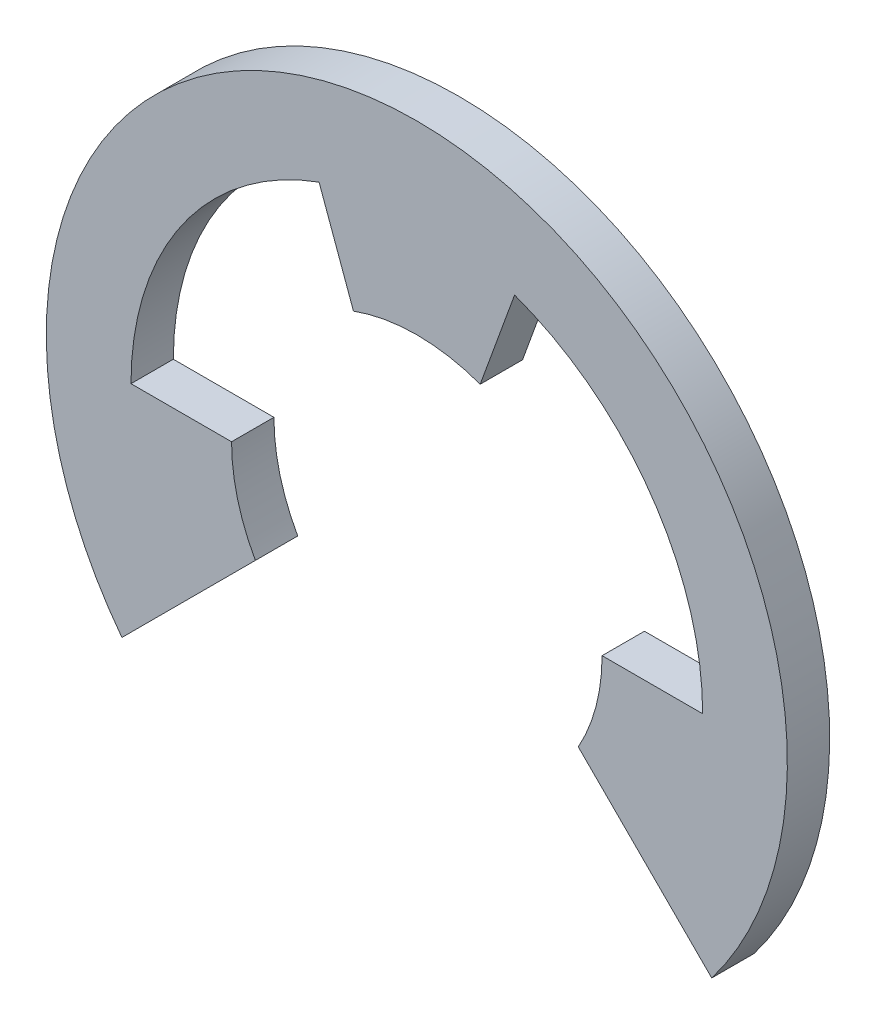
ISO-10303-21;
HEADER;
FILE_DESCRIPTION(('STEP AP214'),'2;1');
FILE_NAME('part.step','',(''),(''),'','','');
FILE_SCHEMA(('AUTOMOTIVE_DESIGN { 1 0 10303 214 1 1 1 1 }'));
ENDSEC;
DATA;
#1=APPLICATION_CONTEXT('core data for automotive mechanical design processes');
#2=APPLICATION_PROTOCOL_DEFINITION('international standard','automotive_design',2000,#1);
#3=PRODUCT_CONTEXT('',#1,'mechanical');
#4=PRODUCT('Part','Part','',(#3));
#5=PRODUCT_RELATED_PRODUCT_CATEGORY('part','',(#4));
#6=PRODUCT_DEFINITION_FORMATION('','',#4);
#7=PRODUCT_DEFINITION_CONTEXT('part definition',#1,'design');
#8=PRODUCT_DEFINITION('design','',#6,#7);
#9=PRODUCT_DEFINITION_SHAPE('','',#8);
#10=(LENGTH_UNIT() NAMED_UNIT(*) SI_UNIT(.MILLI.,.METRE.));
#11=(NAMED_UNIT(*) PLANE_ANGLE_UNIT() SI_UNIT($,.RADIAN.));
#12=(NAMED_UNIT(*) SI_UNIT($,.STERADIAN.) SOLID_ANGLE_UNIT());
#13=UNCERTAINTY_MEASURE_WITH_UNIT(LENGTH_MEASURE(1.E-05),#10,'distance_accuracy_value','');
#14=(GEOMETRIC_REPRESENTATION_CONTEXT(3) GLOBAL_UNCERTAINTY_ASSIGNED_CONTEXT((#13)) GLOBAL_UNIT_ASSIGNED_CONTEXT((#10,
#11,#12)) REPRESENTATION_CONTEXT('',''));
#15=CARTESIAN_POINT('',(0.,0.,0.));
#16=DIRECTION('',(0.,0.,1.));
#17=DIRECTION('',(1.,0.,0.));
#18=AXIS2_PLACEMENT_3D('',#15,#16,#17);
#19=CARTESIAN_POINT('',(0.,1.6362275811209,-0.8));
#20=DIRECTION('',(0.,0.,1.));
#21=DIRECTION('',(1.,0.,0.));
#22=AXIS2_PLACEMENT_3D('',#19,#20,#21);
#23=PLANE('',#22);
#24=DIRECTION('',(0.707106781186533,-0.707106781186562,0.));
#25=VECTOR('',#24,1.);
#26=CARTESIAN_POINT('',(5.5712430835315,-4.2380715548705,-0.8));
#27=LINE('',#26,#25);
#28=CARTESIAN_POINT('',(3.05,-1.7168284713389,-0.8));
#29=VERTEX_POINT('',#28);
#30=CARTESIAN_POINT('',(5.5712430835315,-4.2380715548705,-0.8));
#31=VERTEX_POINT('',#30);
#32=EDGE_CURVE('E106',#29,#31,#27,.T.);
#33=ORIENTED_EDGE('',*,*,#32,.F.);
#34=CARTESIAN_POINT('',(-7.69384556065233E-13,2.42028619368284E-13,-0.8));
#35=DIRECTION('',(0.,0.,-1.));
#36=DIRECTION('',(-1.,0.,0.));
#37=AXIS2_PLACEMENT_3D('',#34,#35,#36);
#38=CIRCLE('',#37,3.50000000000077);
#39=CARTESIAN_POINT('',(3.5,0.,-0.8));
#40=VERTEX_POINT('',#39);
#41=EDGE_CURVE('E129',#29,#40,#38,.F.);
#42=ORIENTED_EDGE('',*,*,#41,.T.);
#43=DIRECTION('',(1.,0.,0.));
#44=VECTOR('',#43,1.);
#45=CARTESIAN_POINT('',(3.5,0.,-0.8));
#46=LINE('',#45,#44);
#47=CARTESIAN_POINT('',(5.4,0.,-0.8));
#48=VERTEX_POINT('',#47);
#49=EDGE_CURVE('E126',#48,#40,#46,.F.);
#50=ORIENTED_EDGE('',*,*,#49,.F.);
#51=CARTESIAN_POINT('',(0.,0.,-0.8));
#52=DIRECTION('',(0.,0.,-1.));
#53=DIRECTION('',(-1.,0.,0.));
#54=AXIS2_PLACEMENT_3D('',#51,#52,#53);
#55=CIRCLE('',#54,5.39999999999994);
#56=CARTESIAN_POINT('',(1.8469087739586,5.0743401522439,-0.8));
#57=VERTEX_POINT('',#56);
#58=EDGE_CURVE('E134',#48,#57,#55,.F.);
#59=ORIENTED_EDGE('',*,*,#58,.T.);
#60=DIRECTION('',(0.342020143325687,0.939692620785902,0.));
#61=VECTOR('',#60,1.);
#62=CARTESIAN_POINT('',(1.8469087739586,5.0743401522439,-0.8));
#63=LINE('',#62,#61);
#64=CARTESIAN_POINT('',(1.1970705016398,3.2889241727507,-0.8));
#65=VERTEX_POINT('',#64);
#66=EDGE_CURVE('E131',#65,#57,#63,.T.);
#67=ORIENTED_EDGE('',*,*,#66,.F.);
#68=CARTESIAN_POINT('',(0.,0.,-0.8));
#69=DIRECTION('',(0.,0.,-1.));
#70=DIRECTION('',(-1.,0.,0.));
#71=AXIS2_PLACEMENT_3D('',#68,#69,#70);
#72=CIRCLE('',#71,3.50000000000009);
#73=CARTESIAN_POINT('',(-1.1970705016398,3.2889241727507,-0.8));
#74=VERTEX_POINT('',#73);
#75=EDGE_CURVE('E139',#65,#74,#72,.F.);
#76=ORIENTED_EDGE('',*,*,#75,.T.);
#77=DIRECTION('',(0.342020143325687,-0.939692620785902,0.));
#78=VECTOR('',#77,1.);
#79=CARTESIAN_POINT('',(-1.1970705016398,3.2889241727507,-0.8));
#80=LINE('',#79,#78);
#81=CARTESIAN_POINT('',(-1.8469087739586,5.0743401522439,-0.8));
#82=VERTEX_POINT('',#81);
#83=EDGE_CURVE('E136',#82,#74,#80,.T.);
#84=ORIENTED_EDGE('',*,*,#83,.F.);
#85=CARTESIAN_POINT('',(-3.23074900165921E-13,2.17048601314218E-13,-0.8));
#86=DIRECTION('',(0.,0.,-1.));
#87=DIRECTION('',(-1.,0.,0.));
#88=AXIS2_PLACEMENT_3D('',#85,#86,#87);
#89=CIRCLE('',#88,5.39999999999968);
#90=CARTESIAN_POINT('',(-5.4,1.08524300657109E-13,-0.8));
#91=VERTEX_POINT('',#90);
#92=EDGE_CURVE('E144',#82,#91,#89,.F.);
#93=ORIENTED_EDGE('',*,*,#92,.T.);
#94=DIRECTION('',(1.,0.,0.));
#95=VECTOR('',#94,1.);
#96=CARTESIAN_POINT('',(-5.4,0.,-0.8));
#97=LINE('',#96,#95);
#98=CARTESIAN_POINT('',(-3.5,0.,-0.8));
#99=VERTEX_POINT('',#98);
#100=EDGE_CURVE('E141',#99,#91,#97,.F.);
#101=ORIENTED_EDGE('',*,*,#100,.F.);
#102=CARTESIAN_POINT('',(8.44324610227432E-13,2.61596300177303E-13,-0.8));
#103=DIRECTION('',(0.,0.,-1.));
#104=DIRECTION('',(-1.,0.,0.));
#105=AXIS2_PLACEMENT_3D('',#102,#103,#104);
#106=CIRCLE('',#105,3.50000000000084);
#107=CARTESIAN_POINT('',(-3.05,-1.7168284713389,-0.8));
#108=VERTEX_POINT('',#107);
#109=EDGE_CURVE('E147',#99,#108,#106,.F.);
#110=ORIENTED_EDGE('',*,*,#109,.T.);
#111=DIRECTION('',(0.707106781186533,0.707106781186562,0.));
#112=VECTOR('',#111,1.);
#113=CARTESIAN_POINT('',(-3.05,-1.7168284713389,-0.8));
#114=LINE('',#113,#112);
#115=CARTESIAN_POINT('',(-5.5712430835315,-4.2380715548705,-0.8));
#116=VERTEX_POINT('',#115);
#117=EDGE_CURVE('E108',#116,#108,#114,.T.);
#118=ORIENTED_EDGE('',*,*,#117,.F.);
#119=CARTESIAN_POINT('',(0.,0.,-0.8));
#120=DIRECTION('',(0.,0.,-1.));
#121=DIRECTION('',(-1.,0.,0.));
#122=AXIS2_PLACEMENT_3D('',#119,#120,#121);
#123=CIRCLE('',#122,7.);
#124=EDGE_CURVE('E20',#31,#116,#123,.F.);
#125=ORIENTED_EDGE('',*,*,#124,.F.);
#126=EDGE_LOOP('',(#33,#42,#50,#59,#67,#76,#84,#93,#101,#110,#118,#125));
#127=FACE_BOUND('',#126,.T.);
#128=ADVANCED_FACE('F17',(#127),#23,.F.);
#129=CARTESIAN_POINT('',(0.,0.,0.));
#130=DIRECTION('',(0.,0.,-1.));
#131=DIRECTION('',(-1.,0.,0.));
#132=AXIS2_PLACEMENT_3D('',#129,#130,#131);
#133=CYLINDRICAL_SURFACE('',#132,7.);
#134=ORIENTED_EDGE('',*,*,#124,.T.);
#135=DIRECTION('',(0.,0.,1.));
#136=VECTOR('',#135,1.);
#137=CARTESIAN_POINT('',(-5.5712430835315,-4.2380715548705,0.));
#138=LINE('',#137,#136);
#139=CARTESIAN_POINT('',(-5.5712430835315,-4.2380715548705,0.));
#140=VERTEX_POINT('',#139);
#141=EDGE_CURVE('E111',#140,#116,#138,.F.);
#142=ORIENTED_EDGE('',*,*,#141,.F.);
#143=CARTESIAN_POINT('',(0.,0.,0.));
#144=DIRECTION('',(0.,0.,-1.));
#145=DIRECTION('',(-1.,0.,0.));
#146=AXIS2_PLACEMENT_3D('',#143,#144,#145);
#147=CIRCLE('',#146,7.);
#148=CARTESIAN_POINT('',(5.5712430835315,-4.2380715548705,0.));
#149=VERTEX_POINT('',#148);
#150=EDGE_CURVE('E116',#149,#140,#147,.F.);
#151=ORIENTED_EDGE('',*,*,#150,.F.);
#152=DIRECTION('',(0.,0.,1.));
#153=VECTOR('',#152,1.);
#154=CARTESIAN_POINT('',(5.5712430835315,-4.2380715548705,0.));
#155=LINE('',#154,#153);
#156=EDGE_CURVE('E113',#31,#149,#155,.T.);
#157=ORIENTED_EDGE('',*,*,#156,.F.);
#158=EDGE_LOOP('',(#134,#142,#151,#157));
#159=FACE_BOUND('',#158,.T.);
#160=ADVANCED_FACE('F114',(#159),#133,.T.);
#161=CARTESIAN_POINT('',(-3.05,-1.7168284713389,0.));
#162=DIRECTION('',(0.707106781186562,-0.707106781186533,0.));
#163=DIRECTION('',(0.707106781186533,0.707106781186562,0.));
#164=AXIS2_PLACEMENT_3D('',#161,#162,#163);
#165=PLANE('',#164);
#166=ORIENTED_EDGE('',*,*,#117,.T.);
#167=DIRECTION('',(0.,0.,-1.));
#168=VECTOR('',#167,1.);
#169=CARTESIAN_POINT('',(-3.05,-1.7168284713389,0.));
#170=LINE('',#169,#168);
#171=CARTESIAN_POINT('',(-3.05,-1.7168284713389,0.));
#172=VERTEX_POINT('',#171);
#173=EDGE_CURVE('E174',#108,#172,#170,.F.);
#174=ORIENTED_EDGE('',*,*,#173,.T.);
#175=DIRECTION('',(0.707106781186533,0.707106781186562,0.));
#176=VECTOR('',#175,1.);
#177=CARTESIAN_POINT('',(-5.5712430835315,-4.2380715548705,0.));
#178=LINE('',#177,#176);
#179=EDGE_CURVE('E166',#140,#172,#178,.T.);
#180=ORIENTED_EDGE('',*,*,#179,.F.);
#181=ORIENTED_EDGE('',*,*,#141,.T.);
#182=EDGE_LOOP('',(#166,#174,#180,#181));
#183=FACE_BOUND('',#182,.T.);
#184=ADVANCED_FACE('F313',(#183),#165,.T.);
#185=CARTESIAN_POINT('',(8.44324610227432E-13,2.61596300177303E-13,0.));
#186=DIRECTION('',(0.,0.,-1.));
#187=DIRECTION('',(-1.,0.,0.));
#188=AXIS2_PLACEMENT_3D('',#185,#186,#187);
#189=CYLINDRICAL_SURFACE('',#188,3.50000000000084);
#190=ORIENTED_EDGE('',*,*,#173,.F.);
#191=ORIENTED_EDGE('',*,*,#109,.F.);
#192=DIRECTION('',(0.,0.,1.));
#193=VECTOR('',#192,1.);
#194=CARTESIAN_POINT('',(-3.5,0.,0.));
#195=LINE('',#194,#193);
#196=CARTESIAN_POINT('',(-3.5,0.,0.));
#197=VERTEX_POINT('',#196);
#198=EDGE_CURVE('E145',#197,#99,#195,.F.);
#199=ORIENTED_EDGE('',*,*,#198,.F.);
#200=CARTESIAN_POINT('',(8.44324610227432E-13,2.61596300177303E-13,0.));
#201=DIRECTION('',(0.,0.,-1.));
#202=DIRECTION('',(-1.,0.,0.));
#203=AXIS2_PLACEMENT_3D('',#200,#201,#202);
#204=CIRCLE('',#203,3.50000000000084);
#205=EDGE_CURVE('E163',#172,#197,#204,.T.);
#206=ORIENTED_EDGE('',*,*,#205,.F.);
#207=EDGE_LOOP('',(#190,#191,#199,#206));
#208=FACE_BOUND('',#207,.T.);
#209=ADVANCED_FACE('F303',(#208),#189,.F.);
#210=CARTESIAN_POINT('',(-5.4,0.,0.));
#211=DIRECTION('',(0.,1.,0.));
#212=DIRECTION('',(0.,0.,1.));
#213=AXIS2_PLACEMENT_3D('',#210,#211,#212);
#214=PLANE('',#213);
#215=ORIENTED_EDGE('',*,*,#100,.T.);
#216=DIRECTION('',(0.,0.,-1.));
#217=VECTOR('',#216,1.);
#218=CARTESIAN_POINT('',(-5.4,2.17048601314218E-13,0.));
#219=LINE('',#218,#217);
#220=CARTESIAN_POINT('',(-5.4,1.08524300657109E-13,0.));
#221=VERTEX_POINT('',#220);
#222=EDGE_CURVE('E173',#91,#221,#219,.F.);
#223=ORIENTED_EDGE('',*,*,#222,.T.);
#224=DIRECTION('',(1.,0.,0.));
#225=VECTOR('',#224,1.);
#226=CARTESIAN_POINT('',(0.,0.,0.));
#227=LINE('',#226,#225);
#228=EDGE_CURVE('E162',#197,#221,#227,.F.);
#229=ORIENTED_EDGE('',*,*,#228,.F.);
#230=ORIENTED_EDGE('',*,*,#198,.T.);
#231=EDGE_LOOP('',(#215,#223,#229,#230));
#232=FACE_BOUND('',#231,.T.);
#233=ADVANCED_FACE('F293',(#232),#214,.T.);
#234=CARTESIAN_POINT('',(-3.23074900165921E-13,2.17048601314218E-13,0.));
#235=DIRECTION('',(0.,0.,-1.));
#236=DIRECTION('',(-1.,0.,0.));
#237=AXIS2_PLACEMENT_3D('',#234,#235,#236);
#238=CYLINDRICAL_SURFACE('',#237,5.39999999999968);
#239=ORIENTED_EDGE('',*,*,#222,.F.);
#240=ORIENTED_EDGE('',*,*,#92,.F.);
#241=DIRECTION('',(0.,0.,1.));
#242=VECTOR('',#241,1.);
#243=CARTESIAN_POINT('',(-1.8469087739586,5.0743401522439,0.));
#244=LINE('',#243,#242);
#245=CARTESIAN_POINT('',(-1.8469087739586,5.0743401522439,0.));
#246=VERTEX_POINT('',#245);
#247=EDGE_CURVE('E140',#246,#82,#244,.F.);
#248=ORIENTED_EDGE('',*,*,#247,.F.);
#249=CARTESIAN_POINT('',(-3.23074900165921E-13,2.17048601314218E-13,0.));
#250=DIRECTION('',(0.,0.,-1.));
#251=DIRECTION('',(-1.,0.,0.));
#252=AXIS2_PLACEMENT_3D('',#249,#250,#251);
#253=CIRCLE('',#252,5.39999999999968);
#254=EDGE_CURVE('E159',#221,#246,#253,.T.);
#255=ORIENTED_EDGE('',*,*,#254,.F.);
#256=EDGE_LOOP('',(#239,#240,#248,#255));
#257=FACE_BOUND('',#256,.T.);
#258=ADVANCED_FACE('F283',(#257),#238,.F.);
#259=CARTESIAN_POINT('',(-1.1970705016398,3.2889241727507,0.));
#260=DIRECTION('',(-0.939692620785902,-0.342020143325687,0.));
#261=DIRECTION('',(0.342020143325687,-0.939692620785902,0.));
#262=AXIS2_PLACEMENT_3D('',#259,#260,#261);
#263=PLANE('',#262);
#264=ORIENTED_EDGE('',*,*,#83,.T.);
#265=DIRECTION('',(0.,0.,-1.));
#266=VECTOR('',#265,1.);
#267=CARTESIAN_POINT('',(-1.1970705016398,3.2889241727507,0.));
#268=LINE('',#267,#266);
#269=CARTESIAN_POINT('',(-1.1970705016398,3.2889241727507,0.));
#270=VERTEX_POINT('',#269);
#271=EDGE_CURVE('E172',#74,#270,#268,.F.);
#272=ORIENTED_EDGE('',*,*,#271,.T.);
#273=DIRECTION('',(0.342020143325687,-0.939692620785902,0.));
#274=VECTOR('',#273,1.);
#275=CARTESIAN_POINT('',(-1.8469087739586,5.0743401522439,0.));
#276=LINE('',#275,#274);
#277=EDGE_CURVE('E158',#246,#270,#276,.T.);
#278=ORIENTED_EDGE('',*,*,#277,.F.);
#279=ORIENTED_EDGE('',*,*,#247,.T.);
#280=EDGE_LOOP('',(#264,#272,#278,#279));
#281=FACE_BOUND('',#280,.T.);
#282=ADVANCED_FACE('F273',(#281),#263,.T.);
#283=CARTESIAN_POINT('',(0.,0.,0.));
#284=DIRECTION('',(0.,0.,-1.));
#285=DIRECTION('',(-1.,0.,0.));
#286=AXIS2_PLACEMENT_3D('',#283,#284,#285);
#287=CYLINDRICAL_SURFACE('',#286,3.50000000000009);
#288=ORIENTED_EDGE('',*,*,#271,.F.);
#289=ORIENTED_EDGE('',*,*,#75,.F.);
#290=DIRECTION('',(0.,0.,1.));
#291=VECTOR('',#290,1.);
#292=CARTESIAN_POINT('',(1.1970705016398,3.2889241727507,0.));
#293=LINE('',#292,#291);
#294=CARTESIAN_POINT('',(1.1970705016398,3.2889241727507,0.));
#295=VERTEX_POINT('',#294);
#296=EDGE_CURVE('E135',#295,#65,#293,.F.);
#297=ORIENTED_EDGE('',*,*,#296,.F.);
#298=CARTESIAN_POINT('',(0.,0.,0.));
#299=DIRECTION('',(0.,0.,-1.));
#300=DIRECTION('',(-1.,0.,0.));
#301=AXIS2_PLACEMENT_3D('',#298,#299,#300);
#302=CIRCLE('',#301,3.50000000000009);
#303=EDGE_CURVE('E155',#270,#295,#302,.T.);
#304=ORIENTED_EDGE('',*,*,#303,.F.);
#305=EDGE_LOOP('',(#288,#289,#297,#304));
#306=FACE_BOUND('',#305,.T.);
#307=ADVANCED_FACE('F263',(#306),#287,.F.);
#308=CARTESIAN_POINT('',(1.8469087739586,5.0743401522439,0.));
#309=DIRECTION('',(0.939692620785902,-0.342020143325687,0.));
#310=DIRECTION('',(0.342020143325687,0.939692620785902,0.));
#311=AXIS2_PLACEMENT_3D('',#308,#309,#310);
#312=PLANE('',#311);
#313=ORIENTED_EDGE('',*,*,#66,.T.);
#314=DIRECTION('',(0.,0.,-1.));
#315=VECTOR('',#314,1.);
#316=CARTESIAN_POINT('',(1.8469087739586,5.0743401522439,0.));
#317=LINE('',#316,#315);
#318=CARTESIAN_POINT('',(1.8469087739586,5.0743401522439,0.));
#319=VERTEX_POINT('',#318);
#320=EDGE_CURVE('E170',#57,#319,#317,.F.);
#321=ORIENTED_EDGE('',*,*,#320,.T.);
#322=DIRECTION('',(0.342020143325687,0.939692620785902,0.));
#323=VECTOR('',#322,1.);
#324=CARTESIAN_POINT('',(1.1970705016398,3.2889241727507,0.));
#325=LINE('',#324,#323);
#326=EDGE_CURVE('E154',#295,#319,#325,.T.);
#327=ORIENTED_EDGE('',*,*,#326,.F.);
#328=ORIENTED_EDGE('',*,*,#296,.T.);
#329=EDGE_LOOP('',(#313,#321,#327,#328));
#330=FACE_BOUND('',#329,.T.);
#331=ADVANCED_FACE('F253',(#330),#312,.T.);
#332=CARTESIAN_POINT('',(0.,0.,0.));
#333=DIRECTION('',(0.,0.,-1.));
#334=DIRECTION('',(-1.,0.,0.));
#335=AXIS2_PLACEMENT_3D('',#332,#333,#334);
#336=CYLINDRICAL_SURFACE('',#335,5.39999999999994);
#337=ORIENTED_EDGE('',*,*,#320,.F.);
#338=ORIENTED_EDGE('',*,*,#58,.F.);
#339=DIRECTION('',(0.,0.,1.));
#340=VECTOR('',#339,1.);
#341=CARTESIAN_POINT('',(5.4,0.,0.));
#342=LINE('',#341,#340);
#343=CARTESIAN_POINT('',(5.4,0.,0.));
#344=VERTEX_POINT('',#343);
#345=EDGE_CURVE('E130',#344,#48,#342,.F.);
#346=ORIENTED_EDGE('',*,*,#345,.F.);
#347=CARTESIAN_POINT('',(0.,0.,0.));
#348=DIRECTION('',(0.,0.,-1.));
#349=DIRECTION('',(-1.,0.,0.));
#350=AXIS2_PLACEMENT_3D('',#347,#348,#349);
#351=CIRCLE('',#350,5.39999999999994);
#352=EDGE_CURVE('E151',#319,#344,#351,.T.);
#353=ORIENTED_EDGE('',*,*,#352,.F.);
#354=EDGE_LOOP('',(#337,#338,#346,#353));
#355=FACE_BOUND('',#354,.T.);
#356=ADVANCED_FACE('F219',(#355),#336,.F.);
#357=CARTESIAN_POINT('',(3.5,0.,0.));
#358=DIRECTION('',(0.,1.,0.));
#359=DIRECTION('',(0.,0.,1.));
#360=AXIS2_PLACEMENT_3D('',#357,#358,#359);
#361=PLANE('',#360);
#362=ORIENTED_EDGE('',*,*,#49,.T.);
#363=DIRECTION('',(0.,0.,-1.));
#364=VECTOR('',#363,1.);
#365=CARTESIAN_POINT('',(3.5,0.,0.));
#366=LINE('',#365,#364);
#367=CARTESIAN_POINT('',(3.5,0.,0.));
#368=VERTEX_POINT('',#367);
#369=EDGE_CURVE('E121',#40,#368,#366,.F.);
#370=ORIENTED_EDGE('',*,*,#369,.T.);
#371=DIRECTION('',(1.,0.,0.));
#372=VECTOR('',#371,1.);
#373=CARTESIAN_POINT('',(0.,0.,0.));
#374=LINE('',#373,#372);
#375=EDGE_CURVE('E150',#344,#368,#374,.F.);
#376=ORIENTED_EDGE('',*,*,#375,.F.);
#377=ORIENTED_EDGE('',*,*,#345,.T.);
#378=EDGE_LOOP('',(#362,#370,#376,#377));
#379=FACE_BOUND('',#378,.T.);
#380=ADVANCED_FACE('F207',(#379),#361,.T.);
#381=CARTESIAN_POINT('',(-7.69384556065233E-13,2.42028619368284E-13,0.));
#382=DIRECTION('',(0.,0.,-1.));
#383=DIRECTION('',(-1.,0.,0.));
#384=AXIS2_PLACEMENT_3D('',#381,#382,#383);
#385=CYLINDRICAL_SURFACE('',#384,3.50000000000077);
#386=ORIENTED_EDGE('',*,*,#369,.F.);
#387=ORIENTED_EDGE('',*,*,#41,.F.);
#388=DIRECTION('',(0.,0.,1.));
#389=VECTOR('',#388,1.);
#390=CARTESIAN_POINT('',(3.05,-1.7168284713389,0.));
#391=LINE('',#390,#389);
#392=CARTESIAN_POINT('',(3.05,-1.7168284713389,0.));
#393=VERTEX_POINT('',#392);
#394=EDGE_CURVE('E35',#393,#29,#391,.F.);
#395=ORIENTED_EDGE('',*,*,#394,.F.);
#396=CARTESIAN_POINT('',(-7.69384556065233E-13,2.42028619368284E-13,0.));
#397=DIRECTION('',(0.,0.,-1.));
#398=DIRECTION('',(-1.,0.,0.));
#399=AXIS2_PLACEMENT_3D('',#396,#397,#398);
#400=CIRCLE('',#399,3.50000000000077);
#401=EDGE_CURVE('E26',#368,#393,#400,.T.);
#402=ORIENTED_EDGE('',*,*,#401,.F.);
#403=EDGE_LOOP('',(#386,#387,#395,#402));
#404=FACE_BOUND('',#403,.T.);
#405=ADVANCED_FACE('F210',(#404),#385,.F.);
#406=CARTESIAN_POINT('',(5.5712430835315,-4.2380715548705,0.));
#407=DIRECTION('',(-0.707106781186562,-0.707106781186533,0.));
#408=DIRECTION('',(0.707106781186533,-0.707106781186562,0.));
#409=AXIS2_PLACEMENT_3D('',#406,#407,#408);
#410=PLANE('',#409);
#411=ORIENTED_EDGE('',*,*,#32,.T.);
#412=ORIENTED_EDGE('',*,*,#156,.T.);
#413=DIRECTION('',(0.707106781186533,-0.707106781186562,0.));
#414=VECTOR('',#413,1.);
#415=CARTESIAN_POINT('',(3.05,-1.7168284713389,0.));
#416=LINE('',#415,#414);
#417=EDGE_CURVE('E11',#393,#149,#416,.T.);
#418=ORIENTED_EDGE('',*,*,#417,.F.);
#419=ORIENTED_EDGE('',*,*,#394,.T.);
#420=EDGE_LOOP('',(#411,#412,#418,#419));
#421=FACE_BOUND('',#420,.T.);
#422=ADVANCED_FACE('F119',(#421),#410,.T.);
#423=CARTESIAN_POINT('',(0.,1.6362275811209,0.));
#424=DIRECTION('',(0.,0.,1.));
#425=DIRECTION('',(1.,0.,0.));
#426=AXIS2_PLACEMENT_3D('',#423,#424,#425);
#427=PLANE('',#426);
#428=ORIENTED_EDGE('',*,*,#401,.T.);
#429=ORIENTED_EDGE('',*,*,#417,.T.);
#430=ORIENTED_EDGE('',*,*,#150,.T.);
#431=ORIENTED_EDGE('',*,*,#179,.T.);
#432=ORIENTED_EDGE('',*,*,#205,.T.);
#433=ORIENTED_EDGE('',*,*,#228,.T.);
#434=ORIENTED_EDGE('',*,*,#254,.T.);
#435=ORIENTED_EDGE('',*,*,#277,.T.);
#436=ORIENTED_EDGE('',*,*,#303,.T.);
#437=ORIENTED_EDGE('',*,*,#326,.T.);
#438=ORIENTED_EDGE('',*,*,#352,.T.);
#439=ORIENTED_EDGE('',*,*,#375,.T.);
#440=EDGE_LOOP('',(#428,#429,#430,#431,#432,#433,#434,#435,#436,#437,#438,#439));
#441=FACE_BOUND('',#440,.T.);
#442=ADVANCED_FACE('F204',(#441),#427,.T.);
#443=CLOSED_SHELL('',(#128,#160,#184,#209,#233,#258,#282,#307,#331,#356,#380,#405,#422,#442));
#444=MANIFOLD_SOLID_BREP('B1',#443);
#445=ADVANCED_BREP_SHAPE_REPRESENTATION('',(#18,#444),#14);
#446=SHAPE_DEFINITION_REPRESENTATION(#9,#445);
ENDSEC;
END-ISO-10303-21;
